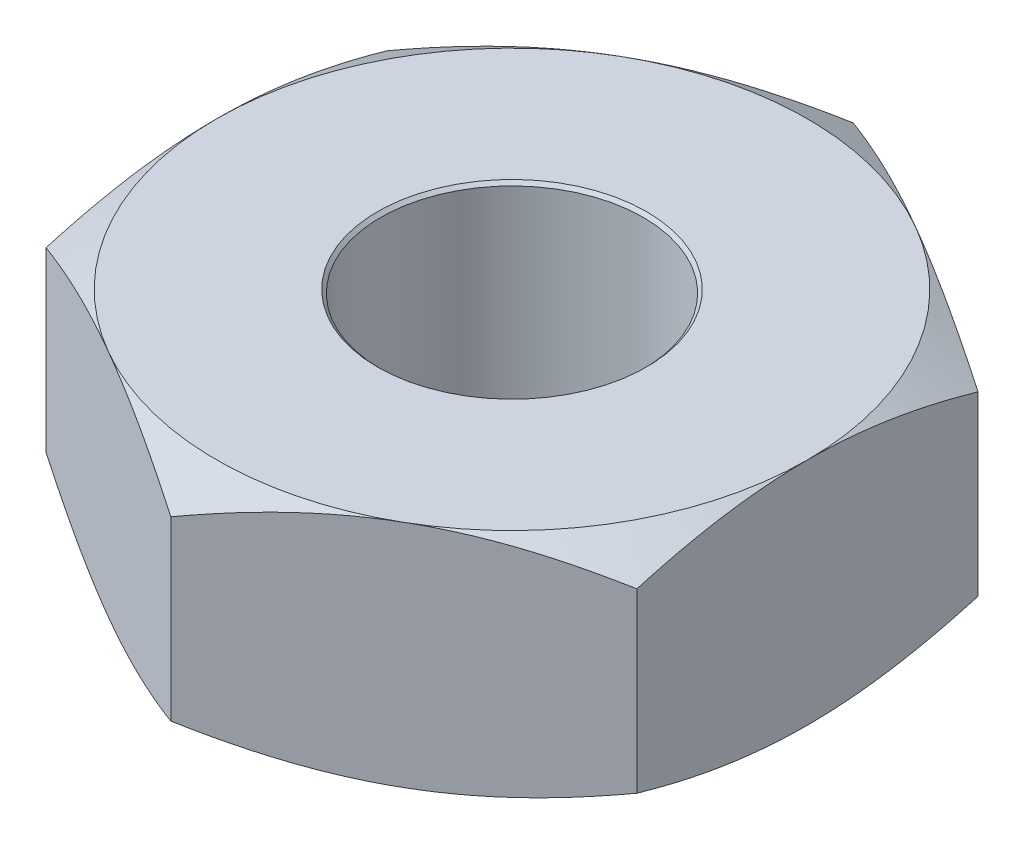
ISO-10303-21;
HEADER;
FILE_DESCRIPTION(('STEP AP214'),'2;1');
FILE_NAME('part.step','',(''),(''),'','','');
FILE_SCHEMA(('AUTOMOTIVE_DESIGN { 1 0 10303 214 1 1 1 1 }'));
ENDSEC;
DATA;
#1=APPLICATION_CONTEXT('core data for automotive mechanical design processes');
#2=APPLICATION_PROTOCOL_DEFINITION('international standard','automotive_design',2000,#1);
#3=PRODUCT_CONTEXT('',#1,'mechanical');
#4=PRODUCT('Part','Part','',(#3));
#5=PRODUCT_RELATED_PRODUCT_CATEGORY('part','',(#4));
#6=PRODUCT_DEFINITION_FORMATION('','',#4);
#7=PRODUCT_DEFINITION_CONTEXT('part definition',#1,'design');
#8=PRODUCT_DEFINITION('design','',#6,#7);
#9=PRODUCT_DEFINITION_SHAPE('','',#8);
#10=(LENGTH_UNIT() NAMED_UNIT(*) SI_UNIT(.MILLI.,.METRE.));
#11=(NAMED_UNIT(*) PLANE_ANGLE_UNIT() SI_UNIT($,.RADIAN.));
#12=(NAMED_UNIT(*) SI_UNIT($,.STERADIAN.) SOLID_ANGLE_UNIT());
#13=UNCERTAINTY_MEASURE_WITH_UNIT(LENGTH_MEASURE(1.E-05),#10,'distance_accuracy_value','');
#14=(GEOMETRIC_REPRESENTATION_CONTEXT(3) GLOBAL_UNCERTAINTY_ASSIGNED_CONTEXT((#13)) GLOBAL_UNIT_ASSIGNED_CONTEXT((#10,
#11,#12)) REPRESENTATION_CONTEXT('',''));
#15=CARTESIAN_POINT('',(0.,0.,0.));
#16=DIRECTION('',(0.,0.,1.));
#17=DIRECTION('',(1.,0.,0.));
#18=AXIS2_PLACEMENT_3D('',#15,#16,#17);
#19=CARTESIAN_POINT('',(-2.24999999999997,1.75,1.29903810567668));
#20=DIRECTION('',(0.499999999999995,0.,-0.866025403784442));
#21=DIRECTION('',(-0.866025403784442,0.,-0.499999999999995));
#22=AXIS2_PLACEMENT_3D('',#19,#20,#21);
#23=PLANE('',#22);
#24=CARTESIAN_POINT('',(0.0002,0.201028565434247,2.59819168140714));
#25=CARTESIAN_POINT('',(-0.0986772488143572,0.168055578047857,2.54110487518744));
#26=CARTESIAN_POINT('',(-0.198407997179093,0.138067535415591,2.48352530077258));
#27=CARTESIAN_POINT('',(-0.399596540220632,0.0857223882308722,2.36736904128968));
#28=CARTESIAN_POINT('',(-0.501057910502945,0.0633838027064733,2.30879029184484));
#29=CARTESIAN_POINT('',(-0.702723189801078,0.0286095576734145,2.19235878855586));
#30=CARTESIAN_POINT('',(-0.802896064976671,0.0159424738337146,2.13452395210774));
#31=CARTESIAN_POINT('',(-1.00371331260268,0.000818907417416121,2.01858206013294));
#32=CARTESIAN_POINT('',(-1.1043569548332,-0.00165009697600391,1.96047542619893));
#33=CARTESIAN_POINT('',(-1.29242516452656,0.00347837463602749,1.85189419470646));
#34=CARTESIAN_POINT('',(-1.37987784389125,0.0098166345151186,1.8014033667339));
#35=CARTESIAN_POINT('',(-1.55421343210876,0.029907657189887,1.70075066794719));
#36=CARTESIAN_POINT('',(-1.64109573768828,0.0436672872310812,1.65058914543304));
#37=CARTESIAN_POINT('',(-1.81579095410172,0.078066265350662,1.5497288152106));
#38=CARTESIAN_POINT('',(-1.90358174743524,0.0988514715826513,1.49904277704713));
#39=CARTESIAN_POINT('',(-2.07785373687757,0.146026087362973,1.39842679703038));
#40=CARTESIAN_POINT('',(-2.16433716675098,0.172404408014295,1.34849556551253));
#41=CARTESIAN_POINT('',(-2.25019999999997,0.201028565434247,1.29892263562284));
#42=B_SPLINE_CURVE_WITH_KNOTS('',3,(#24,#25,#26,#27,#28,#29,#30,#31,#32,#33,#34,#35,#36,#37,#38,
#39,#40,#41),.UNSPECIFIED.,.F.,.F.,(4,2,2,2,2,2,2,2,4),(0.,0.35665882601655,0.714175103224232,
1.06284241804968,1.41108149062515,1.71433394539792,2.0178674925822,2.32813511279242,
2.63779325460355),.UNSPECIFIED.);
#43=CARTESIAN_POINT('',(0.,0.200961894323333,2.5980762113533));
#44=VERTEX_POINT('',#43);
#45=CARTESIAN_POINT('',(-1.12499999999999,0.,1.94855715851499));
#46=VERTEX_POINT('',#45);
#47=EDGE_CURVE('E145',#44,#46,#42,.T.);
#48=ORIENTED_EDGE('',*,*,#47,.F.);
#49=DIRECTION('',(0.,-1.,0.));
#50=VECTOR('',#49,1.);
#51=CARTESIAN_POINT('',(0.,1.75,2.5980762113533));
#52=LINE('',#51,#50);
#53=CARTESIAN_POINT('',(0.,1.54903810567667,2.5980762113533));
#54=VERTEX_POINT('',#53);
#55=EDGE_CURVE('E160',#54,#44,#52,.T.);
#56=ORIENTED_EDGE('',*,*,#55,.F.);
#57=CARTESIAN_POINT('',(-2.25019999999997,1.54897143456575,1.29892263562284));
#58=CARTESIAN_POINT('',(-2.15132275118562,1.58194442195214,1.35600944184254));
#59=CARTESIAN_POINT('',(-2.05159200282088,1.61193246458441,1.4135890162574));
#60=CARTESIAN_POINT('',(-1.85040345977934,1.66427761176913,1.5297452757403));
#61=CARTESIAN_POINT('',(-1.74894208949703,1.68661619729353,1.58832402518514));
#62=CARTESIAN_POINT('',(-1.5472768101989,1.72139044232659,1.70475552847412));
#63=CARTESIAN_POINT('',(-1.4471039350233,1.73405752616629,1.76259036492224));
#64=CARTESIAN_POINT('',(-1.2462866873973,1.74918109258258,1.87853225689704));
#65=CARTESIAN_POINT('',(-1.14564304516677,1.751650096976,1.93663889083105));
#66=CARTESIAN_POINT('',(-0.957574835473412,1.74652162536397,2.04522012232352));
#67=CARTESIAN_POINT('',(-0.870122156108721,1.74018336548488,2.09571095029608));
#68=CARTESIAN_POINT('',(-0.695786567891209,1.72009234281011,2.19636364908279));
#69=CARTESIAN_POINT('',(-0.608904262311697,1.70633271276892,2.24652517159694));
#70=CARTESIAN_POINT('',(-0.434209045898254,1.67193373464934,2.34738550181938));
#71=CARTESIAN_POINT('',(-0.346418252564738,1.65114852841735,2.39807153998285));
#72=CARTESIAN_POINT('',(-0.172146263122401,1.60397391263703,2.4986875199996));
#73=CARTESIAN_POINT('',(-0.0856628332489957,1.5775955919857,2.54861875151745));
#74=CARTESIAN_POINT('',(0.000199999999999916,1.54897143456575,2.59819168140714));
#75=B_SPLINE_CURVE_WITH_KNOTS('',3,(#57,#58,#59,#60,#61,#62,#63,#64,#65,#66,#67,#68,#69,#70,#71,
#72,#73,#74),.UNSPECIFIED.,.F.,.F.,(4,2,2,2,2,2,2,2,4),(0.,0.35665882601655,0.714175103224233,
1.06284241804968,1.41108149062515,1.71433394539792,2.0178674925822,2.32813511279242,
2.63779325460355),.UNSPECIFIED.);
#76=CARTESIAN_POINT('',(-1.12499999999999,1.75,1.94855715851499));
#77=VERTEX_POINT('',#76);
#78=EDGE_CURVE('E224',#77,#54,#75,.T.);
#79=ORIENTED_EDGE('',*,*,#78,.F.);
#80=CARTESIAN_POINT('',(-2.24999999999997,1.54903810567667,1.29903810567668));
#81=VERTEX_POINT('',#80);
#82=EDGE_CURVE('E231',#81,#77,#75,.T.);
#83=ORIENTED_EDGE('',*,*,#82,.F.);
#84=DIRECTION('',(0.,-1.,0.));
#85=VECTOR('',#84,1.);
#86=CARTESIAN_POINT('',(-2.24999999999997,1.75,1.29903810567668));
#87=LINE('',#86,#85);
#88=CARTESIAN_POINT('',(-2.24999999999997,0.200961894323333,1.29903810567668));
#89=VERTEX_POINT('',#88);
#90=EDGE_CURVE('E239',#81,#89,#87,.T.);
#91=ORIENTED_EDGE('',*,*,#90,.T.);
#92=EDGE_CURVE('E213',#46,#89,#42,.T.);
#93=ORIENTED_EDGE('',*,*,#92,.F.);
#94=EDGE_LOOP('',(#48,#56,#79,#83,#91,#93));
#95=FACE_BOUND('',#94,.T.);
#96=ADVANCED_FACE('F35',(#95),#23,.F.);
#97=CARTESIAN_POINT('',(0.,1.75,2.5980762113533));
#98=DIRECTION('',(-0.500000000000001,0.,-0.866025403784438));
#99=DIRECTION('',(-0.866025403784438,0.,0.500000000000001));
#100=AXIS2_PLACEMENT_3D('',#97,#98,#99);
#101=PLANE('',#100);
#102=CARTESIAN_POINT('',(2.25019999999999,0.201028565434247,1.29892263562281));
#103=CARTESIAN_POINT('',(2.15132275118563,0.168055578047856,1.35600944184251));
#104=CARTESIAN_POINT('',(2.0515920028209,0.138067535415591,1.41358901625737));
#105=CARTESIAN_POINT('',(1.85040345977936,0.0857223882308706,1.52974527574027));
#106=CARTESIAN_POINT('',(1.74894208949705,0.0633838027064712,1.58832402518511));
#107=CARTESIAN_POINT('',(1.54727681019892,0.0286095576734114,1.70475552847409));
#108=CARTESIAN_POINT('',(1.44710393502332,0.0159424738337108,1.76259036492222));
#109=CARTESIAN_POINT('',(1.24628668739732,0.000818907417411258,1.87853225689701));
#110=CARTESIAN_POINT('',(1.1456430451668,-0.00165009697600925,1.93663889083103));
#111=CARTESIAN_POINT('',(0.957574835473434,0.00347837463602143,2.0452201223235));
#112=CARTESIAN_POINT('',(0.870122156108741,0.0098166345151125,2.09571095029606));
#113=CARTESIAN_POINT('',(0.695786567891225,0.0299076571898813,2.19636364908278));
#114=CARTESIAN_POINT('',(0.608904262311711,0.0436672872310758,2.24652517159692));
#115=CARTESIAN_POINT('',(0.434209045898263,0.0780662653506577,2.34738550181937));
#116=CARTESIAN_POINT('',(0.346418252564746,0.0988514715826477,2.39807153998285));
#117=CARTESIAN_POINT('',(0.172146263122404,0.146026087362971,2.49868751999959));
#118=CARTESIAN_POINT('',(0.0856628332489972,0.172404408014294,2.54861875151745));
#119=CARTESIAN_POINT('',(-0.000200000000000304,0.201028565434247,2.59819168140714));
#120=B_SPLINE_CURVE_WITH_KNOTS('',3,(#102,#103,#104,#105,#106,#107,#108,#109,#110,#111,#112,
#113,#114,#115,#116,#117,#118,#119),.UNSPECIFIED.,.F.,.F.,(4,2,2,2,2,2,2,2,4),(0.,
0.35665882601655,0.714175103224233,1.06284241804968,1.41108149062515,1.71433394539793,
2.01786749258221,2.32813511279244,2.63779325460359),.UNSPECIFIED.);
#121=CARTESIAN_POINT('',(2.24999999999999,0.200961894323333,1.29903810567665));
#122=VERTEX_POINT('',#121);
#123=CARTESIAN_POINT('',(1.125,0.,1.94855715851499));
#124=VERTEX_POINT('',#123);
#125=EDGE_CURVE('E124',#122,#124,#120,.T.);
#126=ORIENTED_EDGE('',*,*,#125,.F.);
#127=DIRECTION('',(0.,-1.,0.));
#128=VECTOR('',#127,1.);
#129=CARTESIAN_POINT('',(2.24999999999999,1.75,1.29903810567665));
#130=LINE('',#129,#128);
#131=CARTESIAN_POINT('',(2.24999999999999,1.54903810567667,1.29903810567665));
#132=VERTEX_POINT('',#131);
#133=EDGE_CURVE('E251',#132,#122,#130,.T.);
#134=ORIENTED_EDGE('',*,*,#133,.F.);
#135=CARTESIAN_POINT('',(-0.000200000000000074,1.54897143456575,2.59819168140714));
#136=CARTESIAN_POINT('',(0.0986772488143567,1.58194442195214,2.54110487518744));
#137=CARTESIAN_POINT('',(0.198407997179092,1.61193246458441,2.48352530077258));
#138=CARTESIAN_POINT('',(0.39959654022063,1.66427761176913,2.36736904128968));
#139=CARTESIAN_POINT('',(0.501057910502942,1.68661619729353,2.30879029184484));
#140=CARTESIAN_POINT('',(0.702723189801074,1.72139044232659,2.19235878855586));
#141=CARTESIAN_POINT('',(0.802896064976667,1.73405752616629,2.13452395210773));
#142=CARTESIAN_POINT('',(1.00371331260267,1.74918109258259,2.01858206013294));
#143=CARTESIAN_POINT('',(1.10435695483319,1.75165009697601,1.96047542619892));
#144=CARTESIAN_POINT('',(1.29242516452656,1.74652162536398,1.85189419470645));
#145=CARTESIAN_POINT('',(1.37987784389125,1.74018336548489,1.80140336673389));
#146=CARTESIAN_POINT('',(1.55421343210877,1.72009234281012,1.70075066794717));
#147=CARTESIAN_POINT('',(1.64109573768828,1.70633271276892,1.65058914543302));
#148=CARTESIAN_POINT('',(1.81579095410173,1.67193373464934,1.54972881521058));
#149=CARTESIAN_POINT('',(1.90358174743524,1.65114852841735,1.4990427770471));
#150=CARTESIAN_POINT('',(2.07785373687759,1.60397391263703,1.39842679703035));
#151=CARTESIAN_POINT('',(2.16433716675099,1.57759559198571,1.3484955655125));
#152=CARTESIAN_POINT('',(2.25019999999999,1.54897143456575,1.29892263562281));
#153=B_SPLINE_CURVE_WITH_KNOTS('',3,(#135,#136,#137,#138,#139,#140,#141,#142,#143,#144,#145,
#146,#147,#148,#149,#150,#151,#152),.UNSPECIFIED.,.F.,.F.,(4,2,2,2,2,2,2,2,4),(0.,
0.35665882601655,0.714175103224232,1.06284241804968,1.41108149062515,1.71433394539793,
2.01786749258221,2.32813511279244,2.63779325460359),.UNSPECIFIED.);
#154=CARTESIAN_POINT('',(1.125,1.75,1.94855715851497));
#155=VERTEX_POINT('',#154);
#156=EDGE_CURVE('E233',#155,#132,#153,.T.);
#157=ORIENTED_EDGE('',*,*,#156,.F.);
#158=EDGE_CURVE('E232',#54,#155,#153,.T.);
#159=ORIENTED_EDGE('',*,*,#158,.F.);
#160=ORIENTED_EDGE('',*,*,#55,.T.);
#161=EDGE_CURVE('E137',#124,#44,#120,.T.);
#162=ORIENTED_EDGE('',*,*,#161,.F.);
#163=EDGE_LOOP('',(#126,#134,#157,#159,#160,#162));
#164=FACE_BOUND('',#163,.T.);
#165=ADVANCED_FACE('F157',(#164),#101,.F.);
#166=CARTESIAN_POINT('',(2.24999999999999,1.75,1.29903810567665));
#167=DIRECTION('',(-1.,0.,0.));
#168=DIRECTION('',(0.,0.,1.));
#169=AXIS2_PLACEMENT_3D('',#166,#167,#168);
#170=PLANE('',#169);
#171=CARTESIAN_POINT('',(2.24999999999997,1.12189345440879,-3.53839354168716));
#172=CARTESIAN_POINT('',(2.24999999999997,1.07381689263271,-3.43968702230924));
#173=CARTESIAN_POINT('',(2.24999999999997,1.02618738662809,-3.34075908734806));
#174=CARTESIAN_POINT('',(2.24999999999998,0.932073016159549,-3.14234279687417));
#175=CARTESIAN_POINT('',(2.24999999999998,0.885588323028845,-3.04285436018147));
#176=CARTESIAN_POINT('',(2.24999999999998,0.793790693187942,-2.84271015577662));
#177=CARTESIAN_POINT('',(2.24999999999998,0.748485099940266,-2.74205100864245));
#178=CARTESIAN_POINT('',(2.24999999999998,0.659663985324698,-2.53994893284405));
#179=CARTESIAN_POINT('',(2.24999999999998,0.616148382486699,-2.43850604010161));
#180=CARTESIAN_POINT('',(2.24999999999998,0.529951137913691,-2.23124359203539));
#181=CARTESIAN_POINT('',(2.24999999999998,0.487346902181633,-2.12539167338407));
#182=CARTESIAN_POINT('',(2.24999999999998,0.405245804089762,-1.91246771968394));
#183=CARTESIAN_POINT('',(2.24999999999998,0.365749283405793,-1.80539555195302));
#184=CARTESIAN_POINT('',(2.24999999999998,0.290864517372069,-1.59004569346553));
#185=CARTESIAN_POINT('',(2.24999999999998,0.255468368389612,-1.48177077815462));
#186=CARTESIAN_POINT('',(2.24999999999998,0.189887529477515,-1.26366853351124));
#187=CARTESIAN_POINT('',(2.24999999999998,0.15970124962558,-1.15384168889745));
#188=CARTESIAN_POINT('',(2.24999999999998,0.106115988937838,-0.933179524691479));
#189=CARTESIAN_POINT('',(2.24999999999998,0.0826792213152491,-0.822353549743366));
#190=CARTESIAN_POINT('',(2.24999999999998,0.0438866636506034,-0.599273570543113));
#191=CARTESIAN_POINT('',(2.24999999999998,0.0285300017443114,-0.487019721701504));
#192=CARTESIAN_POINT('',(2.24999999999999,0.00732134437037383,-0.263130818473846));
#193=CARTESIAN_POINT('',(2.24999999999999,0.00134332663237845,-0.151508003795488));
#194=CARTESIAN_POINT('',(2.24999999999999,-0.000936284764426156,0.0718484062996929));
#195=CARTESIAN_POINT('',(2.24999999999999,0.00276227423309439,0.183582003436407));
#196=CARTESIAN_POINT('',(2.24999999999999,0.0168788328783875,0.371822826821483));
#197=CARTESIAN_POINT('',(2.24999999999999,0.0248616867557757,0.448525129865842));
#198=CARTESIAN_POINT('',(2.24999999999999,0.0449163776446814,0.601398348033987));
#199=CARTESIAN_POINT('',(2.24999999999999,0.0569887285740803,0.677569195142451));
#200=CARTESIAN_POINT('',(2.24999999999999,0.0987103717056496,0.905153855162318));
#201=CARTESIAN_POINT('',(2.24999999999999,0.133857793287038,1.05556400492303));
#202=CARTESIAN_POINT('',(2.24999999999999,0.215919885548329,1.35680852161716));
#203=CARTESIAN_POINT('',(2.24999999999999,0.263090938580733,1.5075702774342));
#204=CARTESIAN_POINT('',(2.24999999999999,0.339802085098616,1.73161049986243));
#205=CARTESIAN_POINT('',(2.24999999999999,0.366362625537712,1.80593454194757));
#206=CARTESIAN_POINT('',(2.24999999999999,0.421158989940176,1.95396145865595));
#207=CARTESIAN_POINT('',(2.24999999999999,0.449394776403708,2.02766434714137));
#208=CARTESIAN_POINT('',(2.24999999999999,0.527171372756205,2.22505032637719));
#209=CARTESIAN_POINT('',(2.24999999999999,0.578001808570474,2.34822421197225));
#210=CARTESIAN_POINT('',(2.25,0.682625518133925,2.59331188339526));
#211=CARTESIAN_POINT('',(2.25,0.736419105236454,2.71522553432805));
#212=CARTESIAN_POINT('',(2.25,0.846268378663506,2.95807643433748));
#213=CARTESIAN_POINT('',(2.25,0.90232483610627,3.07901333342826));
#214=CARTESIAN_POINT('',(2.25,1.0161709877414,3.32007010456904));
#215=CARTESIAN_POINT('',(2.25,1.07396073407334,3.44018995190748));
#216=CARTESIAN_POINT('',(2.25,1.24952088573151,3.79993711773053));
#217=CARTESIAN_POINT('',(2.25,1.36930993606161,4.03857803401961));
#218=CARTESIAN_POINT('',(2.25,1.61226693923144,4.51405815321574));
#219=CARTESIAN_POINT('',(2.25,1.73543419277131,4.75089771623574));
#220=CARTESIAN_POINT('',(2.25,1.97102942460597,5.19856341283825));
#221=CARTESIAN_POINT('',(2.25000000000001,2.08322765871285,5.40951066425596));
#222=CARTESIAN_POINT('',(2.25000000000001,2.30897975973365,5.83069376778987));
#223=CARTESIAN_POINT('',(2.25000000000001,2.42253370840339,6.04092957601152));
#224=CARTESIAN_POINT('',(2.25000000000001,2.65026914188523,6.46015664385467));
#225=CARTESIAN_POINT('',(2.25000000000001,2.76444729048546,6.66914971794764));
#226=CARTESIAN_POINT('',(2.25000000000001,2.99357534595144,7.08669136434773));
#227=CARTESIAN_POINT('',(2.25000000000001,3.10852519197529,7.29523997002844));
#228=CARTESIAN_POINT('',(2.25000000000001,3.22375587580559,7.50363220026119));
#229=B_SPLINE_CURVE_WITH_KNOTS('',3,(#171,#172,#173,#174,#175,#176,#177,#178,#179,#180,#181,
#182,#183,#184,#185,#186,#187,#188,#189,#190,#191,#192,#193,#194,#195,#196,#197,#198,#199,#200,
#201,#202,#203,#204,#205,#206,#207,#208,#209,#210,#211,#212,#213,#214,#215,#216,#217,#218,#219,
#220,#221,#222,#223,#224,#225,#226,#227,#228),.UNSPECIFIED.,.F.,.F.,(4,2,2,2,2,2,2,2,2,2,2,2,2,
2,2,2,2,2,2,2,2,2,2,2,2,2,2,2,4),(0.,0.329380472235185,0.658809943772019,0.989951131456091,
1.32107723077628,1.66335183979109,2.00566402755003,2.3473050112902,2.68884154964647,
3.02842709235433,3.36797598538851,3.70292198982515,4.03787327835528,4.26911278952257,
4.50038137082525,4.96314563151469,5.43675110565364,5.67351746013594,5.91027851667872,
6.30997151319744,6.7097068587137,7.10957959135647,7.50946436477794,8.31046895155574,
9.11130896070854,9.82808994405625,10.5449143731561,11.2593583460016,11.97374663738),.UNSPECIFIED.);
#230=CARTESIAN_POINT('',(2.24999999999998,0.200961894323333,-1.29903810567666));
#231=VERTEX_POINT('',#230);
#232=CARTESIAN_POINT('',(2.25,0.,0.));
#233=VERTEX_POINT('',#232);
#234=EDGE_CURVE('E50',#231,#233,#229,.T.);
#235=ORIENTED_EDGE('',*,*,#234,.F.);
#236=DIRECTION('',(0.,-1.,0.));
#237=VECTOR('',#236,1.);
#238=CARTESIAN_POINT('',(2.24999999999998,1.75,-1.29903810567666));
#239=LINE('',#238,#237);
#240=CARTESIAN_POINT('',(2.24999999999998,1.54903810567667,-1.29903810567666));
#241=VERTEX_POINT('',#240);
#242=EDGE_CURVE('E248',#241,#231,#239,.T.);
#243=ORIENTED_EDGE('',*,*,#242,.F.);
#244=CARTESIAN_POINT('',(2.24999999999997,0.628106545591214,-3.53839354168716));
#245=CARTESIAN_POINT('',(2.24999999999997,0.676183107367294,-3.43968702230924));
#246=CARTESIAN_POINT('',(2.24999999999997,0.723812613371908,-3.34075908734806));
#247=CARTESIAN_POINT('',(2.24999999999998,0.817926983840451,-3.14234279687417));
#248=CARTESIAN_POINT('',(2.24999999999998,0.864411676971154,-3.04285436018147));
#249=CARTESIAN_POINT('',(2.24999999999998,0.956209306812058,-2.84271015577662));
#250=CARTESIAN_POINT('',(2.24999999999998,1.00151490005973,-2.74205100864245));
#251=CARTESIAN_POINT('',(2.24999999999998,1.0903360146753,-2.53994893284405));
#252=CARTESIAN_POINT('',(2.24999999999998,1.1338516175133,-2.43850604010161));
#253=CARTESIAN_POINT('',(2.24999999999998,1.22004886208631,-2.23124359203539));
#254=CARTESIAN_POINT('',(2.24999999999998,1.26265309781837,-2.12539167338407));
#255=CARTESIAN_POINT('',(2.24999999999998,1.34475419591024,-1.91246771968394));
#256=CARTESIAN_POINT('',(2.24999999999998,1.38425071659421,-1.80539555195302));
#257=CARTESIAN_POINT('',(2.24999999999998,1.45913548262793,-1.59004569346553));
#258=CARTESIAN_POINT('',(2.24999999999998,1.49453163161039,-1.48177077815462));
#259=CARTESIAN_POINT('',(2.24999999999998,1.56011247052248,-1.26366853351124));
#260=CARTESIAN_POINT('',(2.24999999999998,1.59029875037442,-1.15384168889745));
#261=CARTESIAN_POINT('',(2.24999999999998,1.64388401106216,-0.933179524691479));
#262=CARTESIAN_POINT('',(2.24999999999998,1.66732077868475,-0.822353549743367));
#263=CARTESIAN_POINT('',(2.24999999999998,1.7061133363494,-0.599273570543113));
#264=CARTESIAN_POINT('',(2.24999999999998,1.72146999825569,-0.487019721701504));
#265=CARTESIAN_POINT('',(2.24999999999999,1.74267865562963,-0.263130818473846));
#266=CARTESIAN_POINT('',(2.24999999999999,1.74865667336762,-0.151508003795487));
#267=CARTESIAN_POINT('',(2.24999999999999,1.75093628476443,0.0718484062996932));
#268=CARTESIAN_POINT('',(2.24999999999999,1.74723772576691,0.183582003436407));
#269=CARTESIAN_POINT('',(2.24999999999999,1.73312116712161,0.371822826821484));
#270=CARTESIAN_POINT('',(2.24999999999999,1.72513831324422,0.448525129865842));
#271=CARTESIAN_POINT('',(2.24999999999999,1.70508362235532,0.601398348033987));
#272=CARTESIAN_POINT('',(2.24999999999999,1.69301127142592,0.677569195142451));
#273=CARTESIAN_POINT('',(2.24999999999999,1.65128962829435,0.905153855162319));
#274=CARTESIAN_POINT('',(2.24999999999999,1.61614220671296,1.05556400492303));
#275=CARTESIAN_POINT('',(2.24999999999999,1.53408011445167,1.35680852161716));
#276=CARTESIAN_POINT('',(2.24999999999999,1.48690906141927,1.5075702774342));
#277=CARTESIAN_POINT('',(2.24999999999999,1.41019791490138,1.73161049986243));
#278=CARTESIAN_POINT('',(2.24999999999999,1.38363737446229,1.80593454194757));
#279=CARTESIAN_POINT('',(2.24999999999999,1.32884101005982,1.95396145865595));
#280=CARTESIAN_POINT('',(2.24999999999999,1.30060522359629,2.02766434714137));
#281=CARTESIAN_POINT('',(2.24999999999999,1.22282862724379,2.22505032637719));
#282=CARTESIAN_POINT('',(2.24999999999999,1.17199819142953,2.34822421197225));
#283=CARTESIAN_POINT('',(2.25,1.06737448186607,2.59331188339526));
#284=CARTESIAN_POINT('',(2.25,1.01358089476355,2.71522553432805));
#285=CARTESIAN_POINT('',(2.25,0.903731621336493,2.95807643433748));
#286=CARTESIAN_POINT('',(2.25,0.847675163893729,3.07901333342826));
#287=CARTESIAN_POINT('',(2.25,0.733829012258603,3.32007010456905));
#288=CARTESIAN_POINT('',(2.25,0.676039265926662,3.44018995190748));
#289=CARTESIAN_POINT('',(2.25,0.500479114268488,3.79993711773053));
#290=CARTESIAN_POINT('',(2.25,0.380690063938385,4.03857803401961));
#291=CARTESIAN_POINT('',(2.25,0.137733060768556,4.51405815321575));
#292=CARTESIAN_POINT('',(2.25,0.0145658072286846,4.75089771623575));
#293=CARTESIAN_POINT('',(2.25,-0.221029424605968,5.19856341283826));
#294=CARTESIAN_POINT('',(2.25000000000001,-0.333227658712853,5.40951066425597));
#295=CARTESIAN_POINT('',(2.25000000000001,-0.558979759733647,5.83069376778987));
#296=CARTESIAN_POINT('',(2.25000000000001,-0.672533708403394,6.04092957601152));
#297=CARTESIAN_POINT('',(2.25000000000001,-0.900269141885229,6.46015664385467));
#298=CARTESIAN_POINT('',(2.25000000000001,-1.01444729048546,6.66914971794764));
#299=CARTESIAN_POINT('',(2.25000000000001,-1.24357534595144,7.08669136434773));
#300=CARTESIAN_POINT('',(2.25000000000001,-1.3585251919753,7.29523997002844));
#301=CARTESIAN_POINT('',(2.25000000000001,-1.47375587580559,7.50363220026119));
#302=B_SPLINE_CURVE_WITH_KNOTS('',3,(#244,#245,#246,#247,#248,#249,#250,#251,#252,#253,#254,
#255,#256,#257,#258,#259,#260,#261,#262,#263,#264,#265,#266,#267,#268,#269,#270,#271,#272,#273,
#274,#275,#276,#277,#278,#279,#280,#281,#282,#283,#284,#285,#286,#287,#288,#289,#290,#291,#292,
#293,#294,#295,#296,#297,#298,#299,#300,#301),.UNSPECIFIED.,.F.,.F.,(4,2,2,2,2,2,2,2,2,2,2,2,2,
2,2,2,2,2,2,2,2,2,2,2,2,2,2,2,4),(0.,0.329380472235185,0.658809943772019,0.98995113145609,
1.32107723077628,1.66335183979109,2.00566402755003,2.3473050112902,2.68884154964647,
3.02842709235433,3.36797598538851,3.70292198982515,4.03787327835528,4.26911278952257,
4.50038137082525,4.96314563151469,5.43675110565365,5.67351746013595,5.91027851667872,
6.30997151319744,6.7097068587137,7.10957959135647,7.50946436477794,8.31046895155574,
9.11130896070854,9.82808994405626,10.5449143731561,11.2593583460016,11.97374663738),.UNSPECIFIED.);
#303=CARTESIAN_POINT('',(2.24999999999999,1.75,0.));
#304=VERTEX_POINT('',#303);
#305=EDGE_CURVE('E289',#304,#241,#302,.F.);
#306=ORIENTED_EDGE('',*,*,#305,.F.);
#307=EDGE_CURVE('E294',#132,#304,#302,.F.);
#308=ORIENTED_EDGE('',*,*,#307,.F.);
#309=ORIENTED_EDGE('',*,*,#133,.T.);
#310=EDGE_CURVE('E131',#233,#122,#229,.T.);
#311=ORIENTED_EDGE('',*,*,#310,.F.);
#312=EDGE_LOOP('',(#235,#243,#306,#308,#309,#311));
#313=FACE_BOUND('',#312,.T.);
#314=ADVANCED_FACE('F295',(#313),#170,.F.);
#315=CARTESIAN_POINT('',(2.24999999999998,1.75,-1.29903810567666));
#316=DIRECTION('',(-0.499999999999995,0.,0.866025403784442));
#317=DIRECTION('',(0.866025403784442,0.,0.499999999999995));
#318=AXIS2_PLACEMENT_3D('',#315,#316,#317);
#319=PLANE('',#318);
#320=CARTESIAN_POINT('',(-0.00020000000001803,0.201028565434247,-2.59819168140714));
#321=CARTESIAN_POINT('',(0.098677248814339,0.168055578047856,-2.54110487518744));
#322=CARTESIAN_POINT('',(0.198407997179075,0.13806753541559,-2.48352530077258));
#323=CARTESIAN_POINT('',(0.399596540220614,0.0857223882308705,-2.36736904128968));
#324=CARTESIAN_POINT('',(0.501057910502926,0.0633838027064712,-2.30879029184484));
#325=CARTESIAN_POINT('',(0.702723189801059,0.0286095576734113,-2.19235878855586));
#326=CARTESIAN_POINT('',(0.802896064976652,0.0159424738337109,-2.13452395210774));
#327=CARTESIAN_POINT('',(1.00371331260266,0.00081890741741132,-2.01858206013294));
#328=CARTESIAN_POINT('',(1.10435695483318,-0.00165009697600918,-1.96047542619893));
#329=CARTESIAN_POINT('',(1.29242516452654,0.00347837463602137,-1.85189419470645));
#330=CARTESIAN_POINT('',(1.37987784389124,0.00981663451511229,-1.8014033667339));
#331=CARTESIAN_POINT('',(1.55421343210875,0.0299076571898809,-1.70075066794718));
#332=CARTESIAN_POINT('',(1.64109573768827,0.0436672872310755,-1.65058914543304));
#333=CARTESIAN_POINT('',(1.81579095410172,0.0780662653506576,-1.54972881521059));
#334=CARTESIAN_POINT('',(1.90358174743524,0.0988514715826477,-1.49904277704712));
#335=CARTESIAN_POINT('',(2.07785373687758,0.146026087362972,-1.39842679703037));
#336=CARTESIAN_POINT('',(2.16433716675098,0.172404408014294,-1.34849556551252));
#337=CARTESIAN_POINT('',(2.25019999999998,0.201028565434247,-1.29892263562282));
#338=B_SPLINE_CURVE_WITH_KNOTS('',3,(#320,#321,#322,#323,#324,#325,#326,#327,#328,#329,#330,
#331,#332,#333,#334,#335,#336,#337),.UNSPECIFIED.,.F.,.F.,(4,2,2,2,2,2,2,2,4),(0.,
0.35665882601655,0.714175103224232,1.06284241804968,1.41108149062515,1.71433394539793,
2.01786749258221,2.32813511279244,2.63779325460359),.UNSPECIFIED.);
#339=CARTESIAN_POINT('',(0.,0.200961894323333,-2.5980762113533));
#340=VERTEX_POINT('',#339);
#341=CARTESIAN_POINT('',(1.12499999999999,0.,-1.94855715851499));
#342=VERTEX_POINT('',#341);
#343=EDGE_CURVE('E58',#340,#342,#338,.T.);
#344=ORIENTED_EDGE('',*,*,#343,.F.);
#345=DIRECTION('',(0.,-1.,0.));
#346=VECTOR('',#345,1.);
#347=CARTESIAN_POINT('',(0.,1.75,-2.5980762113533));
#348=LINE('',#347,#346);
#349=CARTESIAN_POINT('',(0.,1.54903810567667,-2.5980762113533));
#350=VERTEX_POINT('',#349);
#351=EDGE_CURVE('E245',#350,#340,#348,.T.);
#352=ORIENTED_EDGE('',*,*,#351,.F.);
#353=CARTESIAN_POINT('',(2.25019999999998,1.54897143456575,-1.29892263562282));
#354=CARTESIAN_POINT('',(2.15132275118563,1.58194442195214,-1.35600944184252));
#355=CARTESIAN_POINT('',(2.05159200282089,1.61193246458441,-1.41358901625738));
#356=CARTESIAN_POINT('',(1.85040345977935,1.66427761176913,-1.52974527574028));
#357=CARTESIAN_POINT('',(1.74894208949704,1.68661619729353,-1.58832402518512));
#358=CARTESIAN_POINT('',(1.54727681019891,1.72139044232659,-1.7047555284741));
#359=CARTESIAN_POINT('',(1.44710393502331,1.73405752616629,-1.76259036492223));
#360=CARTESIAN_POINT('',(1.24628668739731,1.74918109258259,-1.87853225689702));
#361=CARTESIAN_POINT('',(1.14564304516678,1.75165009697601,-1.93663889083104));
#362=CARTESIAN_POINT('',(0.957574835473419,1.74652162536398,-2.04522012232351));
#363=CARTESIAN_POINT('',(0.870122156108726,1.74018336548489,-2.09571095029607));
#364=CARTESIAN_POINT('',(0.69578656789121,1.72009234281012,-2.19636364908278));
#365=CARTESIAN_POINT('',(0.608904262311695,1.70633271276892,-2.24652517159693));
#366=CARTESIAN_POINT('',(0.434209045898247,1.67193373464934,-2.34738550181937));
#367=CARTESIAN_POINT('',(0.346418252564729,1.65114852841735,-2.39807153998285));
#368=CARTESIAN_POINT('',(0.172146263122387,1.60397391263703,-2.49868751999959));
#369=CARTESIAN_POINT('',(0.0856628332489798,1.57759559198571,-2.54861875151745));
#370=CARTESIAN_POINT('',(-0.000200000000018127,1.54897143456575,-2.59819168140714));
#371=B_SPLINE_CURVE_WITH_KNOTS('',3,(#353,#354,#355,#356,#357,#358,#359,#360,#361,#362,#363,
#364,#365,#366,#367,#368,#369,#370),.UNSPECIFIED.,.F.,.F.,(4,2,2,2,2,2,2,2,4),(0.,
0.35665882601655,0.714175103224232,1.06284241804968,1.41108149062515,1.71433394539793,
2.01786749258221,2.32813511279244,2.63779325460359),.UNSPECIFIED.);
#372=CARTESIAN_POINT('',(1.12499999999998,1.75,-1.94855715851498));
#373=VERTEX_POINT('',#372);
#374=EDGE_CURVE('E283',#373,#350,#371,.T.);
#375=ORIENTED_EDGE('',*,*,#374,.F.);
#376=EDGE_CURVE('E288',#241,#373,#371,.T.);
#377=ORIENTED_EDGE('',*,*,#376,.F.);
#378=ORIENTED_EDGE('',*,*,#242,.T.);
#379=EDGE_CURVE('E136',#342,#231,#338,.T.);
#380=ORIENTED_EDGE('',*,*,#379,.F.);
#381=EDGE_LOOP('',(#344,#352,#375,#377,#378,#380));
#382=FACE_BOUND('',#381,.T.);
#383=ADVANCED_FACE('F270',(#382),#319,.F.);
#384=CARTESIAN_POINT('',(0.,1.75,-2.5980762113533));
#385=DIRECTION('',(0.500000000000007,0.,0.866025403784435));
#386=DIRECTION('',(0.866025403784435,0.,-0.500000000000007));
#387=AXIS2_PLACEMENT_3D('',#384,#385,#386);
#388=PLANE('',#387);
#389=CARTESIAN_POINT('',(-2.2502,0.201028565434247,-1.29892263562279));
#390=CARTESIAN_POINT('',(-2.15132275118564,0.168055578047856,-1.35600944184249));
#391=CARTESIAN_POINT('',(-2.05159200282091,0.13806753541559,-1.41358901625736));
#392=CARTESIAN_POINT('',(-1.85040345977937,0.0857223882308707,-1.52974527574026));
#393=CARTESIAN_POINT('',(-1.74894208949706,0.0633838027064715,-1.5883240251851));
#394=CARTESIAN_POINT('',(-1.54727681019893,0.0286095576734117,-1.70475552847408));
#395=CARTESIAN_POINT('',(-1.44710393502334,0.0159424738337111,-1.76259036492221));
#396=CARTESIAN_POINT('',(-1.24628668739733,0.000818907417411473,-1.878532256897));
#397=CARTESIAN_POINT('',(-1.14564304516681,-0.00165009697600904,-1.93663889083102));
#398=CARTESIAN_POINT('',(-0.957574835473448,0.0034783746360216,-2.0452201223235));
#399=CARTESIAN_POINT('',(-0.870122156108755,0.00981663451511261,-2.09571095029606));
#400=CARTESIAN_POINT('',(-0.69578656789124,0.0299076571898812,-2.19636364908277));
#401=CARTESIAN_POINT('',(-0.608904262311727,0.0436672872310757,-2.24652517159692));
#402=CARTESIAN_POINT('',(-0.43420904589828,0.0780662653506576,-2.34738550181937));
#403=CARTESIAN_POINT('',(-0.346418252564763,0.0988514715826476,-2.39807153998284));
#404=CARTESIAN_POINT('',(-0.172146263122422,0.146026087362971,-2.49868751999959));
#405=CARTESIAN_POINT('',(-0.0856628332490152,0.172404408014294,-2.54861875151745));
#406=CARTESIAN_POINT('',(0.000199999999981999,0.201028565434247,-2.59819168140714));
#407=B_SPLINE_CURVE_WITH_KNOTS('',3,(#389,#390,#391,#392,#393,#394,#395,#396,#397,#398,#399,
#400,#401,#402,#403,#404,#405,#406),.UNSPECIFIED.,.F.,.F.,(4,2,2,2,2,2,2,2,4),(0.,
0.35665882601655,0.714175103224232,1.06284241804968,1.41108149062515,1.71433394539793,
2.01786749258221,2.32813511279244,2.63779325460359),.UNSPECIFIED.);
#408=CARTESIAN_POINT('',(-2.25,0.200961894323256,-1.29903810567675));
#409=VERTEX_POINT('',#408);
#410=CARTESIAN_POINT('',(-1.12500000000002,0.,-1.94855715851498));
#411=VERTEX_POINT('',#410);
#412=EDGE_CURVE('E207',#409,#411,#407,.T.);
#413=ORIENTED_EDGE('',*,*,#412,.F.);
#414=DIRECTION('',(0.,-1.,0.));
#415=VECTOR('',#414,1.);
#416=CARTESIAN_POINT('',(-2.25,1.75,-1.29903810567663));
#417=LINE('',#416,#415);
#418=CARTESIAN_POINT('',(-2.25,1.54903810567674,-1.29903810567675));
#419=VERTEX_POINT('',#418);
#420=EDGE_CURVE('E242',#419,#409,#417,.T.);
#421=ORIENTED_EDGE('',*,*,#420,.F.);
#422=CARTESIAN_POINT('',(0.000199999999981931,1.54897143456575,-2.59819168140714));
#423=CARTESIAN_POINT('',(-0.0986772488143744,1.58194442195214,-2.54110487518744));
#424=CARTESIAN_POINT('',(-0.19840799717911,1.61193246458441,-2.48352530077258));
#425=CARTESIAN_POINT('',(-0.399596540220647,1.66427761176913,-2.36736904128967));
#426=CARTESIAN_POINT('',(-0.501057910502958,1.68661619729353,-2.30879029184483));
#427=CARTESIAN_POINT('',(-0.70272318980109,1.72139044232659,-2.19235878855585));
#428=CARTESIAN_POINT('',(-0.802896064976682,1.73405752616629,-2.13452395210773));
#429=CARTESIAN_POINT('',(-1.00371331260269,1.74918109258259,-2.01858206013293));
#430=CARTESIAN_POINT('',(-1.10435695483321,1.75165009697601,-1.96047542619891));
#431=CARTESIAN_POINT('',(-1.29242516452657,1.74652162536398,-1.85189419470644));
#432=CARTESIAN_POINT('',(-1.37987784389126,1.74018336548489,-1.80140336673388));
#433=CARTESIAN_POINT('',(-1.55421343210878,1.72009234281012,-1.70075066794716));
#434=CARTESIAN_POINT('',(-1.64109573768829,1.70633271276892,-1.65058914543301));
#435=CARTESIAN_POINT('',(-1.81579095410174,1.67193373464934,-1.54972881521057));
#436=CARTESIAN_POINT('',(-1.90358174743526,1.65114852841735,-1.49904277704709));
#437=CARTESIAN_POINT('',(-2.0778537368776,1.60397391263703,-1.39842679703034));
#438=CARTESIAN_POINT('',(-2.164337166751,1.57759559198571,-1.34849556551249));
#439=CARTESIAN_POINT('',(-2.2502,1.54897143456575,-1.29892263562279));
#440=B_SPLINE_CURVE_WITH_KNOTS('',3,(#422,#423,#424,#425,#426,#427,#428,#429,#430,#431,#432,
#433,#434,#435,#436,#437,#438,#439),.UNSPECIFIED.,.F.,.F.,(4,2,2,2,2,2,2,2,4),(0.,
0.35665882601655,0.714175103224233,1.06284241804968,1.41108149062515,1.71433394539793,
2.01786749258221,2.32813511279244,2.63779325460359),.UNSPECIFIED.);
#441=CARTESIAN_POINT('',(-1.12500000000001,1.75,-1.94855715851497));
#442=VERTEX_POINT('',#441);
#443=EDGE_CURVE('E275',#442,#419,#440,.T.);
#444=ORIENTED_EDGE('',*,*,#443,.F.);
#445=EDGE_CURVE('E281',#350,#442,#440,.T.);
#446=ORIENTED_EDGE('',*,*,#445,.F.);
#447=ORIENTED_EDGE('',*,*,#351,.T.);
#448=EDGE_CURVE('E161',#411,#340,#407,.T.);
#449=ORIENTED_EDGE('',*,*,#448,.F.);
#450=EDGE_LOOP('',(#413,#421,#444,#446,#447,#449));
#451=FACE_BOUND('',#450,.T.);
#452=ADVANCED_FACE('F264',(#451),#388,.F.);
#453=CARTESIAN_POINT('',(-2.25,1.75,-1.29903810567663));
#454=DIRECTION('',(1.,0.,0.));
#455=DIRECTION('',(0.,0.,-1.));
#456=AXIS2_PLACEMENT_3D('',#453,#454,#455);
#457=PLANE('',#456);
#458=CARTESIAN_POINT('',(-2.25000000000002,1.12189345527265,-3.53839354346027));
#459=CARTESIAN_POINT('',(-2.25000000000002,1.07381689346056,-3.43968702402266));
#460=CARTESIAN_POINT('',(-2.25000000000002,1.02618738741996,-3.34075908900174));
#461=CARTESIAN_POINT('',(-2.25000000000002,0.932073016879612,-3.14234279840819));
#462=CARTESIAN_POINT('',(-2.25000000000002,0.885588323713093,-3.04285436165557));
#463=CARTESIAN_POINT('',(-2.25000000000002,0.79379069380054,-2.84271015712998));
#464=CARTESIAN_POINT('',(-2.25000000000002,0.748485100517036,-2.74205100993498));
#465=CARTESIAN_POINT('',(-2.25000000000001,0.659663985830404,-2.53994893401452));
#466=CARTESIAN_POINT('',(-2.25000000000001,0.616148382957167,-2.43850604121085));
#467=CARTESIAN_POINT('',(-2.25000000000001,0.529951138312623,-2.23124359301733));
#468=CARTESIAN_POINT('',(-2.25000000000001,0.487346902544349,-2.12539167429992));
#469=CARTESIAN_POINT('',(-2.25000000000001,0.405245804381964,-1.91246772046654));
#470=CARTESIAN_POINT('',(-2.25000000000001,0.365749283663698,-1.80539555266846));
#471=CARTESIAN_POINT('',(-2.25,0.290864517564634,-1.59004569404542));
#472=CARTESIAN_POINT('',(-2.25,0.255468368551124,-1.48177077866612));
#473=CARTESIAN_POINT('',(-2.25,0.189887529581946,-1.2636685338841));
#474=CARTESIAN_POINT('',(-2.25,0.159701249703978,-1.15384168920007));
#475=CARTESIAN_POINT('',(-2.25,0.106115988963659,-0.933179524817828));
#476=CARTESIAN_POINT('',(-2.25,0.0826792213165055,-0.822353549763202));
#477=CARTESIAN_POINT('',(-2.24999999999999,0.0438866636187554,-0.599273570347322));
#478=CARTESIAN_POINT('',(-2.24999999999999,0.0285300017039113,-0.487019721396602));
#479=CARTESIAN_POINT('',(-2.24999999999999,0.00732134433234053,-0.263130817952508));
#480=CARTESIAN_POINT('',(-2.24999999999999,0.00134332660490107,-0.151508003166847));
#481=CARTESIAN_POINT('',(-2.24999999999999,-0.000936284751972795,0.0718484071413361));
#482=CARTESIAN_POINT('',(-2.24999999999998,0.00276227427492716,0.18358200438375));
#483=CARTESIAN_POINT('',(-2.24999999999998,0.0168788329795992,0.371822827901109));
#484=CARTESIAN_POINT('',(-2.24999999999998,0.024861686880486,0.448525130973248));
#485=CARTESIAN_POINT('',(-2.24999999999998,0.0449163778176305,0.601398349195699));
#486=CARTESIAN_POINT('',(-2.24999999999998,0.0569887287717698,0.677569196330688));
#487=CARTESIAN_POINT('',(-2.24999999999998,0.0987103719780744,0.905153856428665));
#488=CARTESIAN_POINT('',(-2.24999999999998,0.133857793609941,1.05556400623937));
#489=CARTESIAN_POINT('',(-2.24999999999997,0.215919885970974,1.35680852303399));
#490=CARTESIAN_POINT('',(-2.24999999999997,0.263090939052671,1.50757027890146));
#491=CARTESIAN_POINT('',(-2.24999999999997,0.33980208564189,1.73161050140497));
#492=CARTESIAN_POINT('',(-2.24999999999997,0.366362626104312,1.8059345435151));
#493=CARTESIAN_POINT('',(-2.24999999999997,0.421158990552608,1.95396146027345));
#494=CARTESIAN_POINT('',(-2.24999999999997,0.449394777038645,2.02766434878386));
#495=CARTESIAN_POINT('',(-2.24999999999996,0.527171373429724,2.2250503280339));
#496=CARTESIAN_POINT('',(-2.24999999999996,0.578001809257669,2.34822421361893));
#497=CARTESIAN_POINT('',(-2.24999999999996,0.68262551884453,2.59331188502315));
#498=CARTESIAN_POINT('',(-2.24999999999996,0.736419105956791,2.7152255359472));
#499=CARTESIAN_POINT('',(-2.24999999999996,0.846268379400451,2.95807643594009));
#500=CARTESIAN_POINT('',(-2.24999999999995,0.902324836850086,3.07901333502306));
#501=CARTESIAN_POINT('',(-2.24999999999995,1.01617098849692,3.32007010614907));
#502=CARTESIAN_POINT('',(-2.24999999999995,1.07396073483369,3.44018995348053));
#503=CARTESIAN_POINT('',(-2.24999999999995,1.24952088650377,3.79993711928275));
#504=CARTESIAN_POINT('',(-2.24999999999994,1.36930993683872,4.03857803555895));
#505=CARTESIAN_POINT('',(-2.24999999999994,1.61226694001504,4.51405815473102));
#506=CARTESIAN_POINT('',(-2.24999999999994,1.73543419355656,4.75089771773984));
#507=CARTESIAN_POINT('',(-2.24999999999993,1.9710294253973,5.19856341433124));
#508=CARTESIAN_POINT('',(-2.24999999999993,2.08322765950889,5.40951066574889));
#509=CARTESIAN_POINT('',(-2.24999999999993,2.30897976053814,5.83069376928311));
#510=CARTESIAN_POINT('',(-2.24999999999992,2.42253370921163,6.04092957750514));
#511=CARTESIAN_POINT('',(-2.24999999999992,2.65026914270115,6.46015664535094));
#512=CARTESIAN_POINT('',(-2.24999999999992,2.76444729130533,6.66914971944619));
#513=CARTESIAN_POINT('',(-2.24999999999991,2.99357534677878,7.0866913658511));
#514=CARTESIAN_POINT('',(-2.24999999999991,3.10852519280616,7.29523997153435));
#515=CARTESIAN_POINT('',(-2.24999999999991,3.22375587663983,7.50363220176972));
#516=B_SPLINE_CURVE_WITH_KNOTS('',3,(#458,#459,#460,#461,#462,#463,#464,#465,#466,#467,#468,
#469,#470,#471,#472,#473,#474,#475,#476,#477,#478,#479,#480,#481,#482,#483,#484,#485,#486,#487,
#488,#489,#490,#491,#492,#493,#494,#495,#496,#497,#498,#499,#500,#501,#502,#503,#504,#505,#506,
#507,#508,#509,#510,#511,#512,#513,#514,#515),.UNSPECIFIED.,.F.,.F.,(4,2,2,2,2,2,2,2,2,2,2,2,2,
2,2,2,2,2,2,2,2,2,2,2,2,2,2,2,4),(0.,0.329380472443496,0.65880994418867,0.989951132083258,
1.32107723161395,1.66335184085326,2.00566402883678,2.34730501280079,2.68884155138074,
3.02842709441578,3.36797598777666,3.70292199253181,4.0378732813806,4.26911279263807,
4.50038137403093,4.96314563490112,5.43675110922896,5.67351746380543,5.91027852044237,
6.30997151694907,6.70970686245318,7.10957959508343,7.50946436849235,8.31046895524224,
9.11130896436757,9.82808994772176,10.544914376828,11.2593583496852,11.9737466410753),.UNSPECIFIED.);
#517=CARTESIAN_POINT('',(-2.24999999999999,0.,0.));
#518=VERTEX_POINT('',#517);
#519=EDGE_CURVE('E416',#89,#518,#516,.F.);
#520=ORIENTED_EDGE('',*,*,#519,.F.);
#521=ORIENTED_EDGE('',*,*,#90,.F.);
#522=CARTESIAN_POINT('',(-2.25000000000002,0.628106544727349,-3.53839354346027));
#523=CARTESIAN_POINT('',(-2.25000000000002,0.676183106539438,-3.43968702402266));
#524=CARTESIAN_POINT('',(-2.25000000000002,0.723812612580041,-3.34075908900174));
#525=CARTESIAN_POINT('',(-2.25000000000002,0.817926983120388,-3.14234279840819));
#526=CARTESIAN_POINT('',(-2.25000000000002,0.864411676286907,-3.04285436165557));
#527=CARTESIAN_POINT('',(-2.25000000000002,0.95620930619946,-2.84271015712998));
#528=CARTESIAN_POINT('',(-2.25000000000002,1.00151489948296,-2.74205100993498));
#529=CARTESIAN_POINT('',(-2.25000000000001,1.0903360141696,-2.53994893401452));
#530=CARTESIAN_POINT('',(-2.25000000000001,1.13385161704283,-2.43850604121085));
#531=CARTESIAN_POINT('',(-2.25000000000001,1.22004886168738,-2.23124359301733));
#532=CARTESIAN_POINT('',(-2.25000000000001,1.26265309745565,-2.12539167429992));
#533=CARTESIAN_POINT('',(-2.25000000000001,1.34475419561804,-1.91246772046654));
#534=CARTESIAN_POINT('',(-2.25000000000001,1.3842507163363,-1.80539555266846));
#535=CARTESIAN_POINT('',(-2.25,1.45913548243537,-1.59004569404542));
#536=CARTESIAN_POINT('',(-2.25,1.49453163144888,-1.48177077866612));
#537=CARTESIAN_POINT('',(-2.25,1.56011247041805,-1.2636685338841));
#538=CARTESIAN_POINT('',(-2.25,1.59029875029602,-1.15384168920007));
#539=CARTESIAN_POINT('',(-2.25,1.64388401103634,-0.933179524817828));
#540=CARTESIAN_POINT('',(-2.25,1.66732077868349,-0.822353549763202));
#541=CARTESIAN_POINT('',(-2.24999999999999,1.70611333638124,-0.599273570347323));
#542=CARTESIAN_POINT('',(-2.24999999999999,1.72146999829609,-0.487019721396602));
#543=CARTESIAN_POINT('',(-2.24999999999999,1.74267865566766,-0.263130817952508));
#544=CARTESIAN_POINT('',(-2.24999999999999,1.7486566733951,-0.151508003166847));
#545=CARTESIAN_POINT('',(-2.24999999999999,1.75093628475197,0.0718484071413362));
#546=CARTESIAN_POINT('',(-2.24999999999998,1.74723772572507,0.18358200438375));
#547=CARTESIAN_POINT('',(-2.24999999999998,1.7331211670204,0.371822827901109));
#548=CARTESIAN_POINT('',(-2.24999999999998,1.72513831311951,0.448525130973248));
#549=CARTESIAN_POINT('',(-2.24999999999998,1.70508362218237,0.6013983491957));
#550=CARTESIAN_POINT('',(-2.24999999999998,1.69301127122823,0.677569196330689));
#551=CARTESIAN_POINT('',(-2.24999999999998,1.65128962802193,0.905153856428665));
#552=CARTESIAN_POINT('',(-2.24999999999998,1.61614220639006,1.05556400623937));
#553=CARTESIAN_POINT('',(-2.24999999999997,1.53408011402903,1.35680852303399));
#554=CARTESIAN_POINT('',(-2.24999999999997,1.48690906094733,1.50757027890146));
#555=CARTESIAN_POINT('',(-2.24999999999997,1.41019791435811,1.73161050140497));
#556=CARTESIAN_POINT('',(-2.24999999999997,1.38363737389569,1.8059345435151));
#557=CARTESIAN_POINT('',(-2.24999999999997,1.32884100944739,1.95396146027345));
#558=CARTESIAN_POINT('',(-2.24999999999997,1.30060522296136,2.02766434878386));
#559=CARTESIAN_POINT('',(-2.24999999999996,1.22282862657028,2.2250503280339));
#560=CARTESIAN_POINT('',(-2.24999999999996,1.17199819074233,2.34822421361893));
#561=CARTESIAN_POINT('',(-2.24999999999996,1.06737448115547,2.59331188502315));
#562=CARTESIAN_POINT('',(-2.24999999999996,1.01358089404321,2.7152255359472));
#563=CARTESIAN_POINT('',(-2.24999999999996,0.903731620599549,2.95807643594009));
#564=CARTESIAN_POINT('',(-2.24999999999995,0.847675163149914,3.07901333502306));
#565=CARTESIAN_POINT('',(-2.24999999999995,0.733829011503083,3.32007010614907));
#566=CARTESIAN_POINT('',(-2.24999999999995,0.676039265166308,3.44018995348053));
#567=CARTESIAN_POINT('',(-2.24999999999995,0.500479113496228,3.79993711928275));
#568=CARTESIAN_POINT('',(-2.24999999999994,0.38069006316128,4.03857803555895));
#569=CARTESIAN_POINT('',(-2.24999999999994,0.137733059984959,4.51405815473102));
#570=CARTESIAN_POINT('',(-2.24999999999994,0.0145658064434367,4.75089771773984));
#571=CARTESIAN_POINT('',(-2.24999999999993,-0.221029425397296,5.19856341433124));
#572=CARTESIAN_POINT('',(-2.24999999999993,-0.333227659508887,5.40951066574889));
#573=CARTESIAN_POINT('',(-2.24999999999993,-0.558979760538135,5.83069376928311));
#574=CARTESIAN_POINT('',(-2.24999999999992,-0.672533709211629,6.04092957750514));
#575=CARTESIAN_POINT('',(-2.24999999999992,-0.900269142701151,6.46015664535094));
#576=CARTESIAN_POINT('',(-2.24999999999992,-1.01444729130533,6.66914971944619));
#577=CARTESIAN_POINT('',(-2.24999999999991,-1.24357534677878,7.0866913658511));
#578=CARTESIAN_POINT('',(-2.24999999999991,-1.35852519280616,7.29523997153435));
#579=CARTESIAN_POINT('',(-2.24999999999991,-1.47375587663983,7.50363220176972));
#580=B_SPLINE_CURVE_WITH_KNOTS('',3,(#522,#523,#524,#525,#526,#527,#528,#529,#530,#531,#532,
#533,#534,#535,#536,#537,#538,#539,#540,#541,#542,#543,#544,#545,#546,#547,#548,#549,#550,#551,
#552,#553,#554,#555,#556,#557,#558,#559,#560,#561,#562,#563,#564,#565,#566,#567,#568,#569,#570,
#571,#572,#573,#574,#575,#576,#577,#578,#579),.UNSPECIFIED.,.F.,.F.,(4,2,2,2,2,2,2,2,2,2,2,2,2,
2,2,2,2,2,2,2,2,2,2,2,2,2,2,2,4),(0.,0.329380472443496,0.65880994418867,0.989951132083259,
1.32107723161395,1.66335184085326,2.00566402883678,2.34730501280079,2.68884155138074,
3.02842709441578,3.36797598777666,3.70292199253181,4.0378732813806,4.26911279263807,
4.50038137403093,4.96314563490112,5.43675110922896,5.67351746380542,5.91027852044237,
6.30997151694907,6.70970686245318,7.10957959508343,7.50946436849235,8.31046895524224,
9.11130896436757,9.82808994772176,10.544914376828,11.2593583496852,11.9737466410753),.UNSPECIFIED.);
#581=CARTESIAN_POINT('',(-2.24999999999999,1.75,0.));
#582=VERTEX_POINT('',#581);
#583=EDGE_CURVE('E254',#582,#81,#580,.T.);
#584=ORIENTED_EDGE('',*,*,#583,.F.);
#585=EDGE_CURVE('E149',#419,#582,#580,.T.);
#586=ORIENTED_EDGE('',*,*,#585,.F.);
#587=ORIENTED_EDGE('',*,*,#420,.T.);
#588=EDGE_CURVE('E198',#518,#409,#516,.F.);
#589=ORIENTED_EDGE('',*,*,#588,.F.);
#590=EDGE_LOOP('',(#520,#521,#584,#586,#587,#589));
#591=FACE_BOUND('',#590,.T.);
#592=ADVANCED_FACE('F260',(#591),#457,.F.);
#593=CARTESIAN_POINT('',(0.,0.,0.));
#594=DIRECTION('',(0.,1.,0.));
#595=DIRECTION('',(0.,0.,1.));
#596=AXIS2_PLACEMENT_3D('',#593,#594,#595);
#597=PLANE('',#596);
#598=CARTESIAN_POINT('',(0.,0.,0.));
#599=DIRECTION('',(0.,1.,0.));
#600=DIRECTION('',(0.,0.,1.));
#601=AXIS2_PLACEMENT_3D('',#598,#599,#600);
#602=CIRCLE('',#601,1.025);
#603=CARTESIAN_POINT('',(0.,0.,1.025));
#604=VERTEX_POINT('',#603);
#605=EDGE_CURVE('E154',#604,#604,#602,.T.);
#606=ORIENTED_EDGE('',*,*,#605,.T.);
#607=EDGE_LOOP('',(#606));
#608=FACE_BOUND('',#607,.T.);
#609=CARTESIAN_POINT('',(0.,0.,0.));
#610=DIRECTION('',(0.,1.,0.));
#611=DIRECTION('',(0.,0.,1.));
#612=AXIS2_PLACEMENT_3D('',#609,#610,#611);
#613=CIRCLE('',#612,2.25);
#614=EDGE_CURVE('E128',#124,#233,#613,.T.);
#615=ORIENTED_EDGE('',*,*,#614,.F.);
#616=EDGE_CURVE('E142',#46,#124,#613,.T.);
#617=ORIENTED_EDGE('',*,*,#616,.F.);
#618=EDGE_CURVE('E148',#518,#46,#613,.T.);
#619=ORIENTED_EDGE('',*,*,#618,.F.);
#620=EDGE_CURVE('E413',#411,#518,#613,.T.);
#621=ORIENTED_EDGE('',*,*,#620,.F.);
#622=EDGE_CURVE('E155',#342,#411,#613,.T.);
#623=ORIENTED_EDGE('',*,*,#622,.F.);
#624=CARTESIAN_POINT('',(0.,0.,0.));
#625=DIRECTION('',(0.,-1.,0.));
#626=DIRECTION('',(0.,0.,-1.));
#627=AXIS2_PLACEMENT_3D('',#624,#625,#626);
#628=CIRCLE('',#627,2.25);
#629=EDGE_CURVE('E153',#342,#233,#628,.T.);
#630=ORIENTED_EDGE('',*,*,#629,.T.);
#631=EDGE_LOOP('',(#615,#617,#619,#621,#623,#630));
#632=FACE_BOUND('',#631,.T.);
#633=ADVANCED_FACE('F151',(#608,#632),#597,.F.);
#634=CARTESIAN_POINT('',(0.,1.75,0.));
#635=DIRECTION('',(0.,1.,0.));
#636=DIRECTION('',(0.,0.,1.));
#637=AXIS2_PLACEMENT_3D('',#634,#635,#636);
#638=PLANE('',#637);
#639=CARTESIAN_POINT('',(0.,1.75,0.));
#640=DIRECTION('',(0.,1.,0.));
#641=DIRECTION('',(0.,0.,1.));
#642=AXIS2_PLACEMENT_3D('',#639,#640,#641);
#643=CIRCLE('',#642,1.025);
#644=CARTESIAN_POINT('',(0.,1.75,1.025));
#645=VERTEX_POINT('',#644);
#646=EDGE_CURVE('E12',#645,#645,#643,.F.);
#647=ORIENTED_EDGE('',*,*,#646,.T.);
#648=EDGE_LOOP('',(#647));
#649=FACE_BOUND('',#648,.T.);
#650=CARTESIAN_POINT('',(0.,1.75,0.));
#651=DIRECTION('',(0.,1.,0.));
#652=DIRECTION('',(0.,0.,1.));
#653=AXIS2_PLACEMENT_3D('',#650,#651,#652);
#654=CIRCLE('',#653,2.25);
#655=EDGE_CURVE('E307',#77,#155,#654,.T.);
#656=ORIENTED_EDGE('',*,*,#655,.T.);
#657=EDGE_CURVE('E282',#155,#304,#654,.T.);
#658=ORIENTED_EDGE('',*,*,#657,.T.);
#659=EDGE_CURVE('E316',#304,#373,#654,.T.);
#660=ORIENTED_EDGE('',*,*,#659,.T.);
#661=EDGE_CURVE('E327',#373,#442,#654,.T.);
#662=ORIENTED_EDGE('',*,*,#661,.T.);
#663=EDGE_CURVE('E329',#442,#582,#654,.T.);
#664=ORIENTED_EDGE('',*,*,#663,.T.);
#665=EDGE_CURVE('E328',#582,#77,#654,.T.);
#666=ORIENTED_EDGE('',*,*,#665,.T.);
#667=EDGE_LOOP('',(#656,#658,#660,#662,#664,#666));
#668=FACE_BOUND('',#667,.T.);
#669=ADVANCED_FACE('F323',(#649,#668),#638,.T.);
#670=CARTESIAN_POINT('',(0.,1.75,0.));
#671=DIRECTION('',(0.,-1.,0.));
#672=DIRECTION('',(0.,0.,-1.));
#673=AXIS2_PLACEMENT_3D('',#670,#671,#672);
#674=CYLINDRICAL_SURFACE('',#673,1.);
#675=CARTESIAN_POINT('',(0.,0.0249999999999998,0.));
#676=DIRECTION('',(0.,1.,0.));
#677=DIRECTION('',(0.,0.,1.));
#678=AXIS2_PLACEMENT_3D('',#675,#676,#677);
#679=CIRCLE('',#678,1.);
#680=CARTESIAN_POINT('',(0.,0.0249999999999998,1.));
#681=VERTEX_POINT('',#680);
#682=EDGE_CURVE('E43',#681,#681,#679,.F.);
#683=ORIENTED_EDGE('',*,*,#682,.T.);
#684=EDGE_LOOP('',(#683));
#685=FACE_BOUND('',#684,.T.);
#686=CARTESIAN_POINT('',(0.,1.725,0.));
#687=DIRECTION('',(0.,1.,0.));
#688=DIRECTION('',(0.,0.,1.));
#689=AXIS2_PLACEMENT_3D('',#686,#687,#688);
#690=CIRCLE('',#689,1.);
#691=CARTESIAN_POINT('',(0.,1.725,1.));
#692=VERTEX_POINT('',#691);
#693=EDGE_CURVE('E382',#692,#692,#690,.T.);
#694=ORIENTED_EDGE('',*,*,#693,.T.);
#695=EDGE_LOOP('',(#694));
#696=FACE_BOUND('',#695,.T.);
#697=ADVANCED_FACE('F368',(#685,#696),#674,.F.);
#698=CARTESIAN_POINT('',(0.,1.75,0.));
#699=DIRECTION('',(0.,-1.,0.));
#700=DIRECTION('',(0.,0.,1.));
#701=AXIS2_PLACEMENT_3D('',#698,#699,#700);
#702=CONICAL_SURFACE('',#701,2.25,1.0471975511966);
#703=ORIENTED_EDGE('',*,*,#82,.T.);
#704=ORIENTED_EDGE('',*,*,#665,.F.);
#705=ORIENTED_EDGE('',*,*,#583,.T.);
#706=EDGE_LOOP('',(#703,#704,#705));
#707=FACE_BOUND('',#706,.T.);
#708=ADVANCED_FACE('F190',(#707),#702,.T.);
#709=ORIENTED_EDGE('',*,*,#443,.T.);
#710=ORIENTED_EDGE('',*,*,#585,.T.);
#711=ORIENTED_EDGE('',*,*,#663,.F.);
#712=EDGE_LOOP('',(#709,#710,#711));
#713=FACE_BOUND('',#712,.T.);
#714=ADVANCED_FACE('F341',(#713),#702,.T.);
#715=ORIENTED_EDGE('',*,*,#374,.T.);
#716=ORIENTED_EDGE('',*,*,#445,.T.);
#717=ORIENTED_EDGE('',*,*,#661,.F.);
#718=EDGE_LOOP('',(#715,#716,#717));
#719=FACE_BOUND('',#718,.T.);
#720=ADVANCED_FACE('F334',(#719),#702,.T.);
#721=ORIENTED_EDGE('',*,*,#305,.T.);
#722=ORIENTED_EDGE('',*,*,#376,.T.);
#723=ORIENTED_EDGE('',*,*,#659,.F.);
#724=EDGE_LOOP('',(#721,#722,#723));
#725=FACE_BOUND('',#724,.T.);
#726=ADVANCED_FACE('F315',(#725),#702,.T.);
#727=ORIENTED_EDGE('',*,*,#156,.T.);
#728=ORIENTED_EDGE('',*,*,#307,.T.);
#729=ORIENTED_EDGE('',*,*,#657,.F.);
#730=EDGE_LOOP('',(#727,#728,#729));
#731=FACE_BOUND('',#730,.T.);
#732=ADVANCED_FACE('F353',(#731),#702,.T.);
#733=ORIENTED_EDGE('',*,*,#78,.T.);
#734=ORIENTED_EDGE('',*,*,#158,.T.);
#735=ORIENTED_EDGE('',*,*,#655,.F.);
#736=EDGE_LOOP('',(#733,#734,#735));
#737=FACE_BOUND('',#736,.T.);
#738=ADVANCED_FACE('F352',(#737),#702,.T.);
#739=CARTESIAN_POINT('',(0.,0.,0.));
#740=DIRECTION('',(0.,1.,0.));
#741=DIRECTION('',(0.,0.,-1.));
#742=AXIS2_PLACEMENT_3D('',#739,#740,#741);
#743=CONICAL_SURFACE('',#742,2.25,1.0471975511966);
#744=ORIENTED_EDGE('',*,*,#161,.T.);
#745=ORIENTED_EDGE('',*,*,#47,.T.);
#746=ORIENTED_EDGE('',*,*,#616,.T.);
#747=EDGE_LOOP('',(#744,#745,#746));
#748=FACE_BOUND('',#747,.T.);
#749=ADVANCED_FACE('F143',(#748),#743,.T.);
#750=ORIENTED_EDGE('',*,*,#92,.T.);
#751=ORIENTED_EDGE('',*,*,#519,.T.);
#752=ORIENTED_EDGE('',*,*,#618,.T.);
#753=EDGE_LOOP('',(#750,#751,#752));
#754=FACE_BOUND('',#753,.T.);
#755=ADVANCED_FACE('F399',(#754),#743,.T.);
#756=ORIENTED_EDGE('',*,*,#412,.T.);
#757=ORIENTED_EDGE('',*,*,#620,.T.);
#758=ORIENTED_EDGE('',*,*,#588,.T.);
#759=EDGE_LOOP('',(#756,#757,#758));
#760=FACE_BOUND('',#759,.T.);
#761=ADVANCED_FACE('F189',(#760),#743,.T.);
#762=ORIENTED_EDGE('',*,*,#343,.T.);
#763=ORIENTED_EDGE('',*,*,#622,.T.);
#764=ORIENTED_EDGE('',*,*,#448,.T.);
#765=EDGE_LOOP('',(#762,#763,#764));
#766=FACE_BOUND('',#765,.T.);
#767=ADVANCED_FACE('F188',(#766),#743,.T.);
#768=ORIENTED_EDGE('',*,*,#234,.T.);
#769=ORIENTED_EDGE('',*,*,#629,.F.);
#770=ORIENTED_EDGE('',*,*,#379,.T.);
#771=EDGE_LOOP('',(#768,#769,#770));
#772=FACE_BOUND('',#771,.T.);
#773=ADVANCED_FACE('F184',(#772),#743,.T.);
#774=ORIENTED_EDGE('',*,*,#310,.T.);
#775=ORIENTED_EDGE('',*,*,#125,.T.);
#776=ORIENTED_EDGE('',*,*,#614,.T.);
#777=EDGE_LOOP('',(#774,#775,#776));
#778=FACE_BOUND('',#777,.T.);
#779=ADVANCED_FACE('F126',(#778),#743,.T.);
#780=CARTESIAN_POINT('',(0.,0.,0.));
#781=DIRECTION('',(0.,-1.,0.));
#782=DIRECTION('',(0.,0.,-1.));
#783=AXIS2_PLACEMENT_3D('',#780,#781,#782);
#784=CONICAL_SURFACE('',#783,1.025,0.785398163397448);
#785=ORIENTED_EDGE('',*,*,#682,.F.);
#786=EDGE_LOOP('',(#785));
#787=FACE_BOUND('',#786,.T.);
#788=ORIENTED_EDGE('',*,*,#605,.F.);
#789=EDGE_LOOP('',(#788));
#790=FACE_BOUND('',#789,.T.);
#791=ADVANCED_FACE('F221',(#787,#790),#784,.F.);
#792=CARTESIAN_POINT('',(0.,1.725,0.));
#793=DIRECTION('',(0.,1.,0.));
#794=DIRECTION('',(0.,0.,1.));
#795=AXIS2_PLACEMENT_3D('',#792,#793,#794);
#796=CONICAL_SURFACE('',#795,1.,0.785398163397448);
#797=ORIENTED_EDGE('',*,*,#646,.F.);
#798=EDGE_LOOP('',(#797));
#799=FACE_BOUND('',#798,.T.);
#800=ORIENTED_EDGE('',*,*,#693,.F.);
#801=EDGE_LOOP('',(#800));
#802=FACE_BOUND('',#801,.T.);
#803=ADVANCED_FACE('F37',(#799,#802),#796,.F.);
#804=CLOSED_SHELL('',(#96,#165,#314,#383,#452,#592,#633,#669,#697,#708,#714,#720,#726,#732,#738,
#749,#755,#761,#767,#773,#779,#791,#803));
#805=MANIFOLD_SOLID_BREP('B2',#804);
#806=ADVANCED_BREP_SHAPE_REPRESENTATION('',(#18,#805),#14);
#807=SHAPE_DEFINITION_REPRESENTATION(#9,#806);
ENDSEC;
END-ISO-10303-21;
